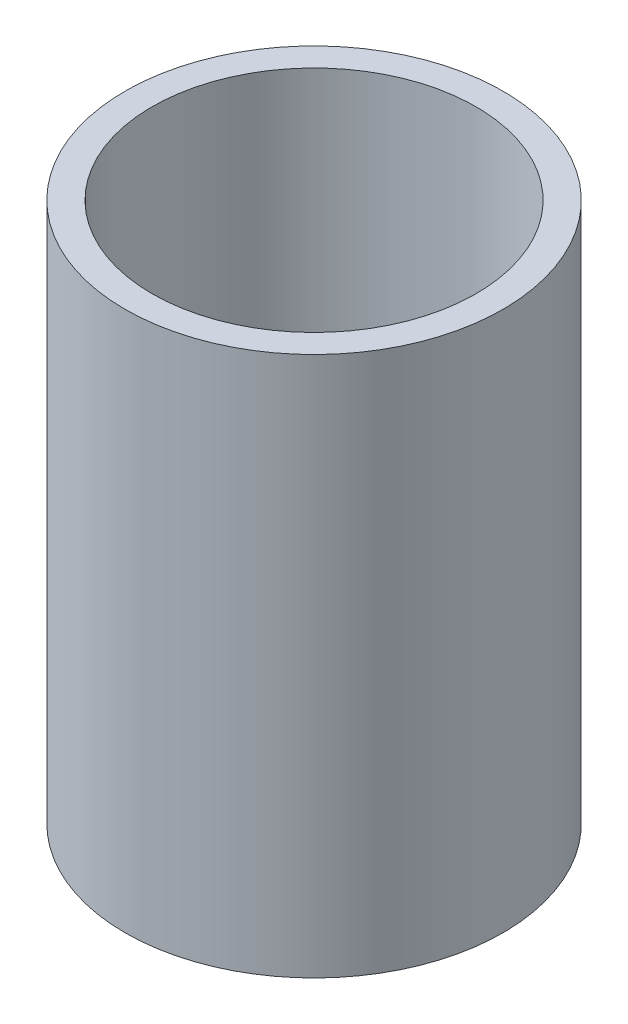
ISO-10303-21;
HEADER;
FILE_DESCRIPTION(('STEP AP214'),'2;1');
FILE_NAME('part.step','',(''),(''),'','','');
FILE_SCHEMA(('AUTOMOTIVE_DESIGN { 1 0 10303 214 1 1 1 1 }'));
ENDSEC;
DATA;
#1=APPLICATION_CONTEXT('core data for automotive mechanical design processes');
#2=APPLICATION_PROTOCOL_DEFINITION('international standard','automotive_design',2000,#1);
#3=PRODUCT_CONTEXT('',#1,'mechanical');
#4=PRODUCT('Part','Part','',(#3));
#5=PRODUCT_RELATED_PRODUCT_CATEGORY('part','',(#4));
#6=PRODUCT_DEFINITION_FORMATION('','',#4);
#7=PRODUCT_DEFINITION_CONTEXT('part definition',#1,'design');
#8=PRODUCT_DEFINITION('design','',#6,#7);
#9=PRODUCT_DEFINITION_SHAPE('','',#8);
#10=(LENGTH_UNIT() NAMED_UNIT(*) SI_UNIT(.MILLI.,.METRE.));
#11=(NAMED_UNIT(*) PLANE_ANGLE_UNIT() SI_UNIT($,.RADIAN.));
#12=(NAMED_UNIT(*) SI_UNIT($,.STERADIAN.) SOLID_ANGLE_UNIT());
#13=UNCERTAINTY_MEASURE_WITH_UNIT(LENGTH_MEASURE(1.E-05),#10,'distance_accuracy_value','');
#14=(GEOMETRIC_REPRESENTATION_CONTEXT(3) GLOBAL_UNCERTAINTY_ASSIGNED_CONTEXT((#13)) GLOBAL_UNIT_ASSIGNED_CONTEXT((#10,
#11,#12)) REPRESENTATION_CONTEXT('',''));
#15=CARTESIAN_POINT('',(0.,0.,0.));
#16=DIRECTION('',(0.,0.,1.));
#17=DIRECTION('',(1.,0.,0.));
#18=AXIS2_PLACEMENT_3D('',#15,#16,#17);
#19=CARTESIAN_POINT('',(17.5,0.,0.));
#20=DIRECTION('',(0.,-1.,0.));
#21=DIRECTION('',(0.,0.,-1.));
#22=AXIS2_PLACEMENT_3D('',#19,#20,#21);
#23=PLANE('',#22);
#24=CARTESIAN_POINT('',(0.,0.,0.));
#25=DIRECTION('',(0.,1.,0.));
#26=DIRECTION('',(0.,0.,1.));
#27=AXIS2_PLACEMENT_3D('',#24,#25,#26);
#28=CIRCLE('',#27,15.);
#29=CARTESIAN_POINT('',(0.,0.,15.));
#30=VERTEX_POINT('',#29);
#31=EDGE_CURVE('E10',#30,#30,#28,.T.);
#32=ORIENTED_EDGE('',*,*,#31,.F.);
#33=EDGE_LOOP('',(#32));
#34=FACE_BOUND('',#33,.T.);
#35=CARTESIAN_POINT('',(0.,0.,0.));
#36=DIRECTION('',(0.,1.,0.));
#37=DIRECTION('',(0.,0.,1.));
#38=AXIS2_PLACEMENT_3D('',#35,#36,#37);
#39=CIRCLE('',#38,17.5);
#40=CARTESIAN_POINT('',(0.,0.,17.5));
#41=VERTEX_POINT('',#40);
#42=EDGE_CURVE('E48',#41,#41,#39,.T.);
#43=ORIENTED_EDGE('',*,*,#42,.T.);
#44=EDGE_LOOP('',(#43));
#45=FACE_BOUND('',#44,.T.);
#46=ADVANCED_FACE('F34',(#34,#45),#23,.F.);
#47=CARTESIAN_POINT('',(0.,0.,0.));
#48=DIRECTION('',(0.,1.,0.));
#49=DIRECTION('',(0.,0.,1.));
#50=AXIS2_PLACEMENT_3D('',#47,#48,#49);
#51=CYLINDRICAL_SURFACE('',#50,15.);
#52=CARTESIAN_POINT('',(0.,-50.,0.));
#53=DIRECTION('',(0.,1.,0.));
#54=DIRECTION('',(0.,0.,1.));
#55=AXIS2_PLACEMENT_3D('',#52,#53,#54);
#56=CIRCLE('',#55,15.);
#57=CARTESIAN_POINT('',(0.,-50.,15.));
#58=VERTEX_POINT('',#57);
#59=EDGE_CURVE('E40',#58,#58,#56,.T.);
#60=ORIENTED_EDGE('',*,*,#59,.F.);
#61=EDGE_LOOP('',(#60));
#62=FACE_BOUND('',#61,.T.);
#63=ORIENTED_EDGE('',*,*,#31,.T.);
#64=EDGE_LOOP('',(#63));
#65=FACE_BOUND('',#64,.T.);
#66=ADVANCED_FACE('F63',(#62,#65),#51,.F.);
#67=CARTESIAN_POINT('',(15.,-50.,0.));
#68=DIRECTION('',(0.,1.,0.));
#69=DIRECTION('',(0.,0.,1.));
#70=AXIS2_PLACEMENT_3D('',#67,#68,#69);
#71=PLANE('',#70);
#72=CARTESIAN_POINT('',(0.,-50.,0.));
#73=DIRECTION('',(0.,1.,0.));
#74=DIRECTION('',(0.,0.,1.));
#75=AXIS2_PLACEMENT_3D('',#72,#73,#74);
#76=CIRCLE('',#75,17.5);
#77=CARTESIAN_POINT('',(0.,-50.,17.5));
#78=VERTEX_POINT('',#77);
#79=EDGE_CURVE('E44',#78,#78,#76,.T.);
#80=ORIENTED_EDGE('',*,*,#79,.F.);
#81=EDGE_LOOP('',(#80));
#82=FACE_BOUND('',#81,.T.);
#83=ORIENTED_EDGE('',*,*,#59,.T.);
#84=EDGE_LOOP('',(#83));
#85=FACE_BOUND('',#84,.T.);
#86=ADVANCED_FACE('F58',(#82,#85),#71,.F.);
#87=CARTESIAN_POINT('',(0.,0.,0.));
#88=DIRECTION('',(0.,1.,0.));
#89=DIRECTION('',(0.,0.,1.));
#90=AXIS2_PLACEMENT_3D('',#87,#88,#89);
#91=CYLINDRICAL_SURFACE('',#90,17.5);
#92=ORIENTED_EDGE('',*,*,#42,.F.);
#93=EDGE_LOOP('',(#92));
#94=FACE_BOUND('',#93,.T.);
#95=ORIENTED_EDGE('',*,*,#79,.T.);
#96=EDGE_LOOP('',(#95));
#97=FACE_BOUND('',#96,.T.);
#98=ADVANCED_FACE('F55',(#94,#97),#91,.T.);
#99=CLOSED_SHELL('',(#46,#66,#86,#98));
#100=MANIFOLD_SOLID_BREP('B2',#99);
#101=ADVANCED_BREP_SHAPE_REPRESENTATION('',(#18,#100),#14);
#102=SHAPE_DEFINITION_REPRESENTATION(#9,#101);
ENDSEC;
END-ISO-10303-21;
